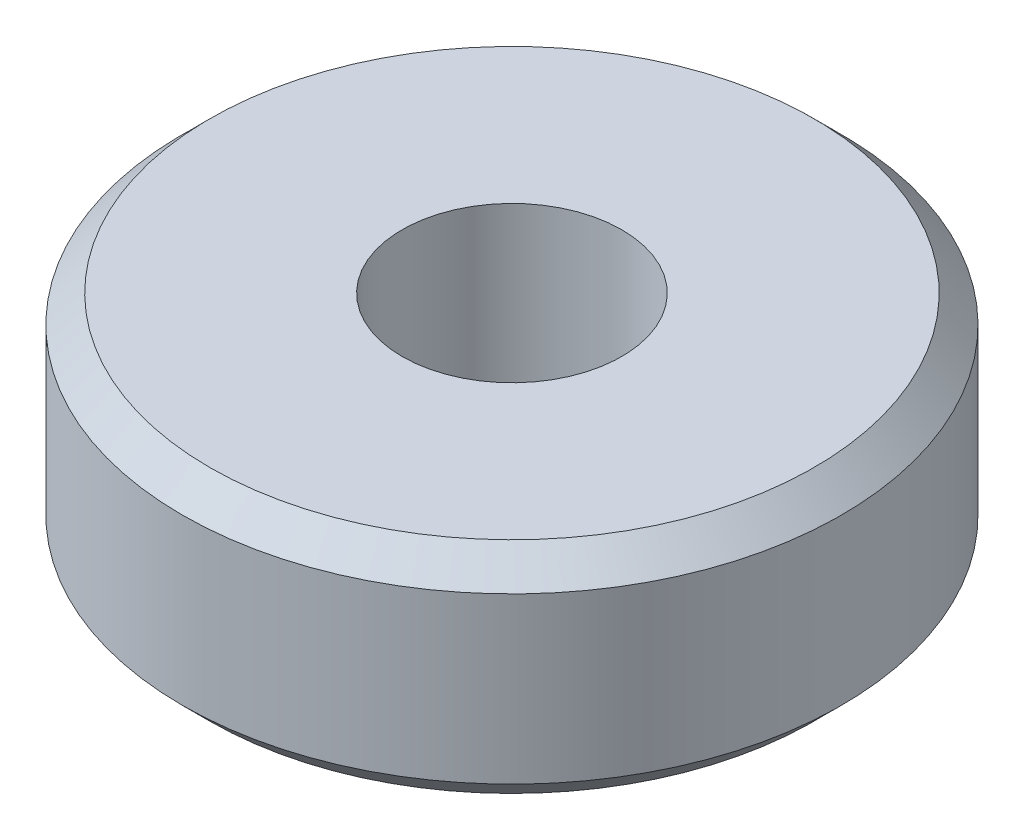
ISO-10303-21;
HEADER;
FILE_DESCRIPTION(('STEP AP214'),'2;1');
FILE_NAME('part.step','',(''),(''),'','','');
FILE_SCHEMA(('AUTOMOTIVE_DESIGN { 1 0 10303 214 1 1 1 1 }'));
ENDSEC;
DATA;
#1=APPLICATION_CONTEXT('core data for automotive mechanical design processes');
#2=APPLICATION_PROTOCOL_DEFINITION('international standard','automotive_design',2000,#1);
#3=PRODUCT_CONTEXT('',#1,'mechanical');
#4=PRODUCT('Part','Part','',(#3));
#5=PRODUCT_RELATED_PRODUCT_CATEGORY('part','',(#4));
#6=PRODUCT_DEFINITION_FORMATION('','',#4);
#7=PRODUCT_DEFINITION_CONTEXT('part definition',#1,'design');
#8=PRODUCT_DEFINITION('design','',#6,#7);
#9=PRODUCT_DEFINITION_SHAPE('','',#8);
#10=(LENGTH_UNIT() NAMED_UNIT(*) SI_UNIT(.MILLI.,.METRE.));
#11=(NAMED_UNIT(*) PLANE_ANGLE_UNIT() SI_UNIT($,.RADIAN.));
#12=(NAMED_UNIT(*) SI_UNIT($,.STERADIAN.) SOLID_ANGLE_UNIT());
#13=UNCERTAINTY_MEASURE_WITH_UNIT(LENGTH_MEASURE(1.E-05),#10,'distance_accuracy_value','');
#14=(GEOMETRIC_REPRESENTATION_CONTEXT(3) GLOBAL_UNCERTAINTY_ASSIGNED_CONTEXT((#13)) GLOBAL_UNIT_ASSIGNED_CONTEXT((#10,
#11,#12)) REPRESENTATION_CONTEXT('',''));
#15=CARTESIAN_POINT('',(0.,0.,0.));
#16=DIRECTION('',(0.,0.,1.));
#17=DIRECTION('',(1.,0.,0.));
#18=AXIS2_PLACEMENT_3D('',#15,#16,#17);
#19=CARTESIAN_POINT('',(0.,4.,0.));
#20=DIRECTION('',(0.,1.,0.));
#21=DIRECTION('',(0.,0.,1.));
#22=AXIS2_PLACEMENT_3D('',#19,#20,#21);
#23=PLANE('',#22);
#24=CARTESIAN_POINT('',(0.,4.,0.));
#25=DIRECTION('',(0.,1.,0.));
#26=DIRECTION('',(0.,0.,1.));
#27=AXIS2_PLACEMENT_3D('',#24,#25,#26);
#28=CIRCLE('',#27,5.5);
#29=CARTESIAN_POINT('',(0.,4.,5.5));
#30=VERTEX_POINT('',#29);
#31=EDGE_CURVE('E10',#30,#30,#28,.T.);
#32=ORIENTED_EDGE('',*,*,#31,.T.);
#33=EDGE_LOOP('',(#32));
#34=FACE_BOUND('',#33,.T.);
#35=CARTESIAN_POINT('',(0.,4.,0.));
#36=DIRECTION('',(0.,1.,0.));
#37=DIRECTION('',(0.,0.,1.));
#38=AXIS2_PLACEMENT_3D('',#35,#36,#37);
#39=CIRCLE('',#38,2.);
#40=CARTESIAN_POINT('',(0.,4.,2.));
#41=VERTEX_POINT('',#40);
#42=EDGE_CURVE('E51',#41,#41,#39,.T.);
#43=ORIENTED_EDGE('',*,*,#42,.F.);
#44=EDGE_LOOP('',(#43));
#45=FACE_BOUND('',#44,.T.);
#46=ADVANCED_FACE('F31',(#34,#45),#23,.T.);
#47=CARTESIAN_POINT('',(0.,0.,0.));
#48=DIRECTION('',(0.,1.,0.));
#49=DIRECTION('',(0.,0.,1.));
#50=AXIS2_PLACEMENT_3D('',#47,#48,#49);
#51=PLANE('',#50);
#52=CARTESIAN_POINT('',(0.,0.,0.));
#53=DIRECTION('',(0.,1.,0.));
#54=DIRECTION('',(0.,0.,1.));
#55=AXIS2_PLACEMENT_3D('',#52,#53,#54);
#56=CIRCLE('',#55,5.5);
#57=CARTESIAN_POINT('',(0.,0.,5.5));
#58=VERTEX_POINT('',#57);
#59=EDGE_CURVE('E38',#58,#58,#56,.F.);
#60=ORIENTED_EDGE('',*,*,#59,.T.);
#61=EDGE_LOOP('',(#60));
#62=FACE_BOUND('',#61,.T.);
#63=CARTESIAN_POINT('',(0.,0.,0.));
#64=DIRECTION('',(0.,1.,0.));
#65=DIRECTION('',(0.,0.,1.));
#66=AXIS2_PLACEMENT_3D('',#63,#64,#65);
#67=CIRCLE('',#66,2.);
#68=CARTESIAN_POINT('',(0.,0.,2.));
#69=VERTEX_POINT('',#68);
#70=EDGE_CURVE('E52',#69,#69,#67,.T.);
#71=ORIENTED_EDGE('',*,*,#70,.T.);
#72=EDGE_LOOP('',(#71));
#73=FACE_BOUND('',#72,.T.);
#74=ADVANCED_FACE('F62',(#62,#73),#51,.F.);
#75=CARTESIAN_POINT('',(0.,4.,0.));
#76=DIRECTION('',(0.,-1.,0.));
#77=DIRECTION('',(0.,0.,-1.));
#78=AXIS2_PLACEMENT_3D('',#75,#76,#77);
#79=CYLINDRICAL_SURFACE('',#78,6.);
#80=CARTESIAN_POINT('',(0.,0.500000000000001,0.));
#81=DIRECTION('',(0.,1.,0.));
#82=DIRECTION('',(0.,0.,1.));
#83=AXIS2_PLACEMENT_3D('',#80,#81,#82);
#84=CIRCLE('',#83,6.);
#85=CARTESIAN_POINT('',(0.,0.500000000000001,6.));
#86=VERTEX_POINT('',#85);
#87=EDGE_CURVE('E42',#86,#86,#84,.T.);
#88=ORIENTED_EDGE('',*,*,#87,.T.);
#89=EDGE_LOOP('',(#88));
#90=FACE_BOUND('',#89,.T.);
#91=CARTESIAN_POINT('',(0.,3.49999999999999,0.));
#92=DIRECTION('',(0.,1.,0.));
#93=DIRECTION('',(0.,0.,1.));
#94=AXIS2_PLACEMENT_3D('',#91,#92,#93);
#95=CIRCLE('',#94,6.);
#96=CARTESIAN_POINT('',(0.,3.49999999999999,6.));
#97=VERTEX_POINT('',#96);
#98=EDGE_CURVE('E46',#97,#97,#95,.F.);
#99=ORIENTED_EDGE('',*,*,#98,.T.);
#100=EDGE_LOOP('',(#99));
#101=FACE_BOUND('',#100,.T.);
#102=ADVANCED_FACE('F67',(#90,#101),#79,.T.);
#103=CARTESIAN_POINT('',(0.,4.,0.));
#104=DIRECTION('',(0.,-1.,0.));
#105=DIRECTION('',(0.,0.,-1.));
#106=AXIS2_PLACEMENT_3D('',#103,#104,#105);
#107=CYLINDRICAL_SURFACE('',#106,2.);
#108=ORIENTED_EDGE('',*,*,#42,.T.);
#109=EDGE_LOOP('',(#108));
#110=FACE_BOUND('',#109,.T.);
#111=ORIENTED_EDGE('',*,*,#70,.F.);
#112=EDGE_LOOP('',(#111));
#113=FACE_BOUND('',#112,.T.);
#114=ADVANCED_FACE('F58',(#110,#113),#107,.F.);
#115=CARTESIAN_POINT('',(0.,0.500000000000001,0.));
#116=DIRECTION('',(0.,1.,0.));
#117=DIRECTION('',(0.,0.,1.));
#118=AXIS2_PLACEMENT_3D('',#115,#116,#117);
#119=CONICAL_SURFACE('',#118,6.,0.78539816339745);
#120=ORIENTED_EDGE('',*,*,#59,.F.);
#121=EDGE_LOOP('',(#120));
#122=FACE_BOUND('',#121,.T.);
#123=ORIENTED_EDGE('',*,*,#87,.F.);
#124=EDGE_LOOP('',(#123));
#125=FACE_BOUND('',#124,.T.);
#126=ADVANCED_FACE('F73',(#122,#125),#119,.T.);
#127=CARTESIAN_POINT('',(0.,4.,0.));
#128=DIRECTION('',(0.,-1.,0.));
#129=DIRECTION('',(0.,0.,-1.));
#130=AXIS2_PLACEMENT_3D('',#127,#128,#129);
#131=CONICAL_SURFACE('',#130,5.5,0.785398163397446);
#132=ORIENTED_EDGE('',*,*,#98,.F.);
#133=EDGE_LOOP('',(#132));
#134=FACE_BOUND('',#133,.T.);
#135=ORIENTED_EDGE('',*,*,#31,.F.);
#136=EDGE_LOOP('',(#135));
#137=FACE_BOUND('',#136,.T.);
#138=ADVANCED_FACE('F33',(#134,#137),#131,.T.);
#139=CLOSED_SHELL('',(#46,#74,#102,#114,#126,#138));
#140=MANIFOLD_SOLID_BREP('B2',#139);
#141=ADVANCED_BREP_SHAPE_REPRESENTATION('',(#18,#140),#14);
#142=SHAPE_DEFINITION_REPRESENTATION(#9,#141);
ENDSEC;
END-ISO-10303-21;
